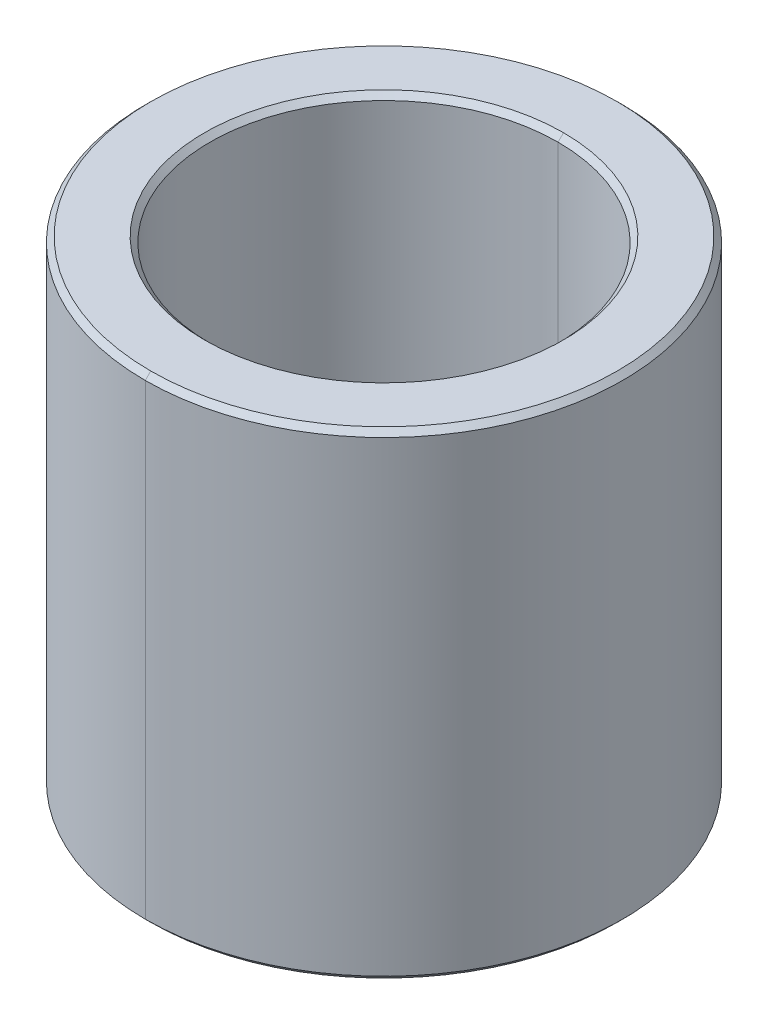
ISO-10303-21;
HEADER;
FILE_DESCRIPTION(('STEP AP214'),'2;1');
FILE_NAME('part.step','',(''),(''),'','','');
FILE_SCHEMA(('AUTOMOTIVE_DESIGN { 1 0 10303 214 1 1 1 1 }'));
ENDSEC;
DATA;
#1=APPLICATION_CONTEXT('core data for automotive mechanical design processes');
#2=APPLICATION_PROTOCOL_DEFINITION('international standard','automotive_design',2000,#1);
#3=PRODUCT_CONTEXT('',#1,'mechanical');
#4=PRODUCT('Part','Part','',(#3));
#5=PRODUCT_RELATED_PRODUCT_CATEGORY('part','',(#4));
#6=PRODUCT_DEFINITION_FORMATION('','',#4);
#7=PRODUCT_DEFINITION_CONTEXT('part definition',#1,'design');
#8=PRODUCT_DEFINITION('design','',#6,#7);
#9=PRODUCT_DEFINITION_SHAPE('','',#8);
#10=(LENGTH_UNIT() NAMED_UNIT(*) SI_UNIT(.MILLI.,.METRE.));
#11=(NAMED_UNIT(*) PLANE_ANGLE_UNIT() SI_UNIT($,.RADIAN.));
#12=(NAMED_UNIT(*) SI_UNIT($,.STERADIAN.) SOLID_ANGLE_UNIT());
#13=UNCERTAINTY_MEASURE_WITH_UNIT(LENGTH_MEASURE(1.E-05),#10,'distance_accuracy_value','');
#14=(GEOMETRIC_REPRESENTATION_CONTEXT(3) GLOBAL_UNCERTAINTY_ASSIGNED_CONTEXT((#13)) GLOBAL_UNIT_ASSIGNED_CONTEXT((#10,
#11,#12)) REPRESENTATION_CONTEXT('',''));
#15=CARTESIAN_POINT('',(0.,0.,0.));
#16=DIRECTION('',(0.,0.,1.));
#17=DIRECTION('',(1.,0.,0.));
#18=AXIS2_PLACEMENT_3D('',#15,#16,#17);
#19=CARTESIAN_POINT('',(0.,11.1125,0.));
#20=DIRECTION('',(0.,-1.,0.));
#21=DIRECTION('',(0.,0.,-1.));
#22=AXIS2_PLACEMENT_3D('',#19,#20,#21);
#23=CONICAL_SURFACE('',#22,5.42925,0.785398163397448);
#24=DIRECTION('',(0.,-0.707106781186548,0.707106781186548));
#25=VECTOR('',#24,1.);
#26=CARTESIAN_POINT('',(0.,11.1125,5.42925));
#27=LINE('',#26,#25);
#28=CARTESIAN_POINT('',(0.,11.1125,5.42925));
#29=VERTEX_POINT('',#28);
#30=CARTESIAN_POINT('',(0.,10.9855,5.55625));
#31=VERTEX_POINT('',#30);
#32=EDGE_CURVE('E166',#29,#31,#27,.T.);
#33=ORIENTED_EDGE('',*,*,#32,.F.);
#34=CARTESIAN_POINT('',(0.,11.1125,0.));
#35=DIRECTION('',(0.,1.,0.));
#36=DIRECTION('',(0.,0.,1.));
#37=AXIS2_PLACEMENT_3D('',#34,#35,#36);
#38=CIRCLE('',#37,5.42925);
#39=CARTESIAN_POINT('',(0.,11.1125,-5.42925));
#40=VERTEX_POINT('',#39);
#41=EDGE_CURVE('E76',#40,#29,#38,.T.);
#42=ORIENTED_EDGE('',*,*,#41,.F.);
#43=DIRECTION('',(0.,-0.707106781186548,-0.707106781186548));
#44=VECTOR('',#43,1.);
#45=CARTESIAN_POINT('',(0.,11.1125,-5.42925));
#46=LINE('',#45,#44);
#47=CARTESIAN_POINT('',(0.,10.9855,-5.55625));
#48=VERTEX_POINT('',#47);
#49=EDGE_CURVE('E156',#40,#48,#46,.T.);
#50=ORIENTED_EDGE('',*,*,#49,.T.);
#51=CARTESIAN_POINT('',(0.,10.9855,0.));
#52=DIRECTION('',(0.,-1.,0.));
#53=DIRECTION('',(0.,0.,1.));
#54=AXIS2_PLACEMENT_3D('',#51,#52,#53);
#55=CIRCLE('',#54,5.55625);
#56=EDGE_CURVE('E128',#31,#48,#55,.T.);
#57=ORIENTED_EDGE('',*,*,#56,.F.);
#58=EDGE_LOOP('',(#33,#42,#50,#57));
#59=FACE_BOUND('',#58,.T.);
#60=ADVANCED_FACE('F16',(#59),#23,.T.);
#61=CARTESIAN_POINT('',(0.,10.9855,0.));
#62=DIRECTION('',(0.,1.,0.));
#63=DIRECTION('',(0.,0.,1.));
#64=AXIS2_PLACEMENT_3D('',#61,#62,#63);
#65=CONICAL_SURFACE('',#64,4.0513,0.785398163397442);
#66=DIRECTION('',(0.,0.707106781186552,-0.707106781186543));
#67=VECTOR('',#66,1.);
#68=CARTESIAN_POINT('',(0.,10.9855,-4.0513));
#69=LINE('',#68,#67);
#70=CARTESIAN_POINT('',(0.,10.9855,-4.0513));
#71=VERTEX_POINT('',#70);
#72=CARTESIAN_POINT('',(0.,11.1125,-4.1783));
#73=VERTEX_POINT('',#72);
#74=EDGE_CURVE('E163',#71,#73,#69,.T.);
#75=ORIENTED_EDGE('',*,*,#74,.F.);
#76=CARTESIAN_POINT('',(0.,10.9855,0.));
#77=DIRECTION('',(0.,1.,0.));
#78=DIRECTION('',(0.,0.,1.));
#79=AXIS2_PLACEMENT_3D('',#76,#77,#78);
#80=CIRCLE('',#79,4.0513);
#81=CARTESIAN_POINT('',(0.,10.9855,4.0513));
#82=VERTEX_POINT('',#81);
#83=EDGE_CURVE('E27',#82,#71,#80,.T.);
#84=ORIENTED_EDGE('',*,*,#83,.F.);
#85=DIRECTION('',(0.,0.707106781186552,0.707106781186543));
#86=VECTOR('',#85,1.);
#87=CARTESIAN_POINT('',(0.,10.9855,4.0513));
#88=LINE('',#87,#86);
#89=CARTESIAN_POINT('',(0.,11.1125,4.1783));
#90=VERTEX_POINT('',#89);
#91=EDGE_CURVE('E153',#82,#90,#88,.T.);
#92=ORIENTED_EDGE('',*,*,#91,.T.);
#93=CARTESIAN_POINT('',(0.,11.1125,0.));
#94=DIRECTION('',(0.,-1.,0.));
#95=DIRECTION('',(0.,0.,1.));
#96=AXIS2_PLACEMENT_3D('',#93,#94,#95);
#97=CIRCLE('',#96,4.1783);
#98=EDGE_CURVE('E176',#73,#90,#97,.T.);
#99=ORIENTED_EDGE('',*,*,#98,.F.);
#100=EDGE_LOOP('',(#75,#84,#92,#99));
#101=FACE_BOUND('',#100,.T.);
#102=ADVANCED_FACE('F341',(#101),#65,.F.);
#103=CARTESIAN_POINT('',(0.,0.126999999999997,0.));
#104=DIRECTION('',(0.,1.,0.));
#105=DIRECTION('',(0.,0.,1.));
#106=AXIS2_PLACEMENT_3D('',#103,#104,#105);
#107=CONICAL_SURFACE('',#106,5.55625,0.785398163397452);
#108=DIRECTION('',(0.,0.707106781186545,-0.70710678118655));
#109=VECTOR('',#108,1.);
#110=CARTESIAN_POINT('',(0.,0.126999999999997,-5.55625));
#111=LINE('',#110,#109);
#112=CARTESIAN_POINT('',(0.,0.,-5.42925));
#113=VERTEX_POINT('',#112);
#114=CARTESIAN_POINT('',(0.,0.126999999999997,-5.55625));
#115=VERTEX_POINT('',#114);
#116=EDGE_CURVE('E122',#113,#115,#111,.T.);
#117=ORIENTED_EDGE('',*,*,#116,.F.);
#118=CARTESIAN_POINT('',(0.,0.,0.));
#119=DIRECTION('',(0.,-1.,0.));
#120=DIRECTION('',(0.,0.,1.));
#121=AXIS2_PLACEMENT_3D('',#118,#119,#120);
#122=CIRCLE('',#121,5.42925);
#123=CARTESIAN_POINT('',(0.,0.,5.42925));
#124=VERTEX_POINT('',#123);
#125=EDGE_CURVE('E179',#124,#113,#122,.T.);
#126=ORIENTED_EDGE('',*,*,#125,.F.);
#127=DIRECTION('',(0.,0.707106781186545,0.70710678118655));
#128=VECTOR('',#127,1.);
#129=CARTESIAN_POINT('',(0.,0.126999999999997,5.55625));
#130=LINE('',#129,#128);
#131=CARTESIAN_POINT('',(0.,0.126999999999997,5.55625));
#132=VERTEX_POINT('',#131);
#133=EDGE_CURVE('E125',#124,#132,#130,.T.);
#134=ORIENTED_EDGE('',*,*,#133,.T.);
#135=CARTESIAN_POINT('',(0.,0.126999999999997,0.));
#136=DIRECTION('',(0.,1.,0.));
#137=DIRECTION('',(0.,0.,1.));
#138=AXIS2_PLACEMENT_3D('',#135,#136,#137);
#139=CIRCLE('',#138,5.55625);
#140=EDGE_CURVE('E112',#115,#132,#139,.T.);
#141=ORIENTED_EDGE('',*,*,#140,.F.);
#142=EDGE_LOOP('',(#117,#126,#134,#141));
#143=FACE_BOUND('',#142,.T.);
#144=ADVANCED_FACE('F120',(#143),#107,.T.);
#145=CARTESIAN_POINT('',(0.,0.,0.));
#146=DIRECTION('',(0.,-1.,0.));
#147=DIRECTION('',(0.,0.,-1.));
#148=AXIS2_PLACEMENT_3D('',#145,#146,#147);
#149=CONICAL_SURFACE('',#148,4.1783,0.785398163397448);
#150=DIRECTION('',(0.,-0.707106781186548,0.707106781186548));
#151=VECTOR('',#150,1.);
#152=CARTESIAN_POINT('',(0.,0.,4.1783));
#153=LINE('',#152,#151);
#154=CARTESIAN_POINT('',(0.,0.127,4.0513));
#155=VERTEX_POINT('',#154);
#156=CARTESIAN_POINT('',(0.,0.,4.1783));
#157=VERTEX_POINT('',#156);
#158=EDGE_CURVE('E20',#155,#157,#153,.T.);
#159=ORIENTED_EDGE('',*,*,#158,.F.);
#160=CARTESIAN_POINT('',(0.,0.127,0.));
#161=DIRECTION('',(0.,-1.,0.));
#162=DIRECTION('',(0.,0.,1.));
#163=AXIS2_PLACEMENT_3D('',#160,#161,#162);
#164=CIRCLE('',#163,4.0513);
#165=CARTESIAN_POINT('',(0.,0.127,-4.0513));
#166=VERTEX_POINT('',#165);
#167=EDGE_CURVE('E11',#166,#155,#164,.T.);
#168=ORIENTED_EDGE('',*,*,#167,.F.);
#169=DIRECTION('',(0.,-0.707106781186548,-0.707106781186548));
#170=VECTOR('',#169,1.);
#171=CARTESIAN_POINT('',(0.,0.,-4.1783));
#172=LINE('',#171,#170);
#173=CARTESIAN_POINT('',(0.,0.,-4.1783));
#174=VERTEX_POINT('',#173);
#175=EDGE_CURVE('E185',#166,#174,#172,.T.);
#176=ORIENTED_EDGE('',*,*,#175,.T.);
#177=CARTESIAN_POINT('',(0.,0.,0.));
#178=DIRECTION('',(0.,1.,0.));
#179=DIRECTION('',(0.,0.,1.));
#180=AXIS2_PLACEMENT_3D('',#177,#178,#179);
#181=CIRCLE('',#180,4.1783);
#182=EDGE_CURVE('E41',#157,#174,#181,.T.);
#183=ORIENTED_EDGE('',*,*,#182,.F.);
#184=EDGE_LOOP('',(#159,#168,#176,#183));
#185=FACE_BOUND('',#184,.T.);
#186=ADVANCED_FACE('F234',(#185),#149,.F.);
#187=CARTESIAN_POINT('',(0.,11.1125,0.));
#188=DIRECTION('',(0.,-1.,0.));
#189=DIRECTION('',(0.,0.,-1.));
#190=AXIS2_PLACEMENT_3D('',#187,#188,#189);
#191=CYLINDRICAL_SURFACE('',#190,4.0513);
#192=DIRECTION('',(0.,-1.,0.));
#193=VECTOR('',#192,1.);
#194=CARTESIAN_POINT('',(0.,11.1125,4.0513));
#195=LINE('',#194,#193);
#196=EDGE_CURVE('E180',#82,#155,#195,.T.);
#197=ORIENTED_EDGE('',*,*,#196,.F.);
#198=ORIENTED_EDGE('',*,*,#83,.T.);
#199=DIRECTION('',(0.,-1.,0.));
#200=VECTOR('',#199,1.);
#201=CARTESIAN_POINT('',(0.,11.1125,-4.0513));
#202=LINE('',#201,#200);
#203=EDGE_CURVE('E184',#71,#166,#202,.T.);
#204=ORIENTED_EDGE('',*,*,#203,.T.);
#205=ORIENTED_EDGE('',*,*,#167,.T.);
#206=EDGE_LOOP('',(#197,#198,#204,#205));
#207=FACE_BOUND('',#206,.T.);
#208=ADVANCED_FACE('F220',(#207),#191,.F.);
#209=CARTESIAN_POINT('',(0.,11.1125,0.));
#210=DIRECTION('',(0.,-1.,0.));
#211=DIRECTION('',(0.,0.,-1.));
#212=AXIS2_PLACEMENT_3D('',#209,#210,#211);
#213=CYLINDRICAL_SURFACE('',#212,5.55625);
#214=DIRECTION('',(0.,-1.,0.));
#215=VECTOR('',#214,1.);
#216=CARTESIAN_POINT('',(0.,11.1125,5.55625));
#217=LINE('',#216,#215);
#218=EDGE_CURVE('E137',#31,#132,#217,.T.);
#219=ORIENTED_EDGE('',*,*,#218,.F.);
#220=ORIENTED_EDGE('',*,*,#56,.T.);
#221=DIRECTION('',(0.,-1.,0.));
#222=VECTOR('',#221,1.);
#223=CARTESIAN_POINT('',(0.,11.1125,-5.55625));
#224=LINE('',#223,#222);
#225=EDGE_CURVE('E131',#48,#115,#224,.T.);
#226=ORIENTED_EDGE('',*,*,#225,.T.);
#227=ORIENTED_EDGE('',*,*,#140,.T.);
#228=EDGE_LOOP('',(#219,#220,#226,#227));
#229=FACE_BOUND('',#228,.T.);
#230=ADVANCED_FACE('F133',(#229),#213,.T.);
#231=CARTESIAN_POINT('',(0.,0.,0.));
#232=DIRECTION('',(0.,1.,0.));
#233=DIRECTION('',(1.,0.,0.));
#234=AXIS2_PLACEMENT_3D('',#231,#232,#233);
#235=PLANE('',#234);
#236=CARTESIAN_POINT('',(0.,0.,0.));
#237=DIRECTION('',(0.,1.,0.));
#238=DIRECTION('',(0.,0.,1.));
#239=AXIS2_PLACEMENT_3D('',#236,#237,#238);
#240=CIRCLE('',#239,4.1783);
#241=EDGE_CURVE('E190',#174,#157,#240,.T.);
#242=ORIENTED_EDGE('',*,*,#241,.T.);
#243=ORIENTED_EDGE('',*,*,#182,.T.);
#244=EDGE_LOOP('',(#242,#243));
#245=FACE_BOUND('',#244,.T.);
#246=ORIENTED_EDGE('',*,*,#125,.T.);
#247=CARTESIAN_POINT('',(0.,0.,0.));
#248=DIRECTION('',(0.,-1.,0.));
#249=DIRECTION('',(0.,0.,1.));
#250=AXIS2_PLACEMENT_3D('',#247,#248,#249);
#251=CIRCLE('',#250,5.42925);
#252=EDGE_CURVE('E146',#113,#124,#251,.T.);
#253=ORIENTED_EDGE('',*,*,#252,.T.);
#254=EDGE_LOOP('',(#246,#253));
#255=FACE_BOUND('',#254,.T.);
#256=ADVANCED_FACE('F332',(#245,#255),#235,.F.);
#257=CARTESIAN_POINT('',(0.,11.1125,0.));
#258=DIRECTION('',(0.,1.,0.));
#259=DIRECTION('',(1.,0.,0.));
#260=AXIS2_PLACEMENT_3D('',#257,#258,#259);
#261=PLANE('',#260);
#262=CARTESIAN_POINT('',(0.,11.1125,0.));
#263=DIRECTION('',(0.,-1.,0.));
#264=DIRECTION('',(0.,0.,1.));
#265=AXIS2_PLACEMENT_3D('',#262,#263,#264);
#266=CIRCLE('',#265,4.1783);
#267=EDGE_CURVE('E159',#90,#73,#266,.T.);
#268=ORIENTED_EDGE('',*,*,#267,.T.);
#269=ORIENTED_EDGE('',*,*,#98,.T.);
#270=EDGE_LOOP('',(#268,#269));
#271=FACE_BOUND('',#270,.T.);
#272=ORIENTED_EDGE('',*,*,#41,.T.);
#273=CARTESIAN_POINT('',(0.,11.1125,0.));
#274=DIRECTION('',(0.,1.,0.));
#275=DIRECTION('',(0.,0.,1.));
#276=AXIS2_PLACEMENT_3D('',#273,#274,#275);
#277=CIRCLE('',#276,5.42925);
#278=EDGE_CURVE('E171',#29,#40,#277,.T.);
#279=ORIENTED_EDGE('',*,*,#278,.T.);
#280=EDGE_LOOP('',(#272,#279));
#281=FACE_BOUND('',#280,.T.);
#282=ADVANCED_FACE('F328',(#271,#281),#261,.T.);
#283=CARTESIAN_POINT('',(0.,11.1125,0.));
#284=DIRECTION('',(0.,-1.,0.));
#285=DIRECTION('',(0.,0.,-1.));
#286=AXIS2_PLACEMENT_3D('',#283,#284,#285);
#287=CYLINDRICAL_SURFACE('',#286,5.55625);
#288=CARTESIAN_POINT('',(0.,10.9855,0.));
#289=DIRECTION('',(0.,-1.,0.));
#290=DIRECTION('',(0.,0.,1.));
#291=AXIS2_PLACEMENT_3D('',#288,#289,#290);
#292=CIRCLE('',#291,5.55625);
#293=EDGE_CURVE('E170',#48,#31,#292,.T.);
#294=ORIENTED_EDGE('',*,*,#293,.T.);
#295=ORIENTED_EDGE('',*,*,#218,.T.);
#296=CARTESIAN_POINT('',(0.,0.126999999999997,0.));
#297=DIRECTION('',(0.,1.,0.));
#298=DIRECTION('',(0.,0.,1.));
#299=AXIS2_PLACEMENT_3D('',#296,#297,#298);
#300=CIRCLE('',#299,5.55625);
#301=EDGE_CURVE('E139',#132,#115,#300,.T.);
#302=ORIENTED_EDGE('',*,*,#301,.T.);
#303=ORIENTED_EDGE('',*,*,#225,.F.);
#304=EDGE_LOOP('',(#294,#295,#302,#303));
#305=FACE_BOUND('',#304,.T.);
#306=ADVANCED_FACE('F140',(#305),#287,.T.);
#307=CARTESIAN_POINT('',(0.,11.1125,0.));
#308=DIRECTION('',(0.,-1.,0.));
#309=DIRECTION('',(0.,0.,-1.));
#310=AXIS2_PLACEMENT_3D('',#307,#308,#309);
#311=CYLINDRICAL_SURFACE('',#310,4.0513);
#312=CARTESIAN_POINT('',(0.,10.9855,0.));
#313=DIRECTION('',(0.,1.,0.));
#314=DIRECTION('',(0.,0.,1.));
#315=AXIS2_PLACEMENT_3D('',#312,#313,#314);
#316=CIRCLE('',#315,4.0513);
#317=EDGE_CURVE('E232',#71,#82,#316,.T.);
#318=ORIENTED_EDGE('',*,*,#317,.T.);
#319=ORIENTED_EDGE('',*,*,#196,.T.);
#320=CARTESIAN_POINT('',(0.,0.127,0.));
#321=DIRECTION('',(0.,-1.,0.));
#322=DIRECTION('',(0.,0.,1.));
#323=AXIS2_PLACEMENT_3D('',#320,#321,#322);
#324=CIRCLE('',#323,4.0513);
#325=EDGE_CURVE('E172',#155,#166,#324,.T.);
#326=ORIENTED_EDGE('',*,*,#325,.T.);
#327=ORIENTED_EDGE('',*,*,#203,.F.);
#328=EDGE_LOOP('',(#318,#319,#326,#327));
#329=FACE_BOUND('',#328,.T.);
#330=ADVANCED_FACE('F229',(#329),#311,.F.);
#331=CARTESIAN_POINT('',(0.,0.,0.));
#332=DIRECTION('',(0.,-1.,0.));
#333=DIRECTION('',(0.,0.,-1.));
#334=AXIS2_PLACEMENT_3D('',#331,#332,#333);
#335=CONICAL_SURFACE('',#334,4.1783,0.785398163397448);
#336=ORIENTED_EDGE('',*,*,#325,.F.);
#337=ORIENTED_EDGE('',*,*,#158,.T.);
#338=ORIENTED_EDGE('',*,*,#241,.F.);
#339=ORIENTED_EDGE('',*,*,#175,.F.);
#340=EDGE_LOOP('',(#336,#337,#338,#339));
#341=FACE_BOUND('',#340,.T.);
#342=ADVANCED_FACE('F18',(#341),#335,.F.);
#343=CARTESIAN_POINT('',(0.,0.126999999999997,0.));
#344=DIRECTION('',(0.,1.,0.));
#345=DIRECTION('',(0.,0.,1.));
#346=AXIS2_PLACEMENT_3D('',#343,#344,#345);
#347=CONICAL_SURFACE('',#346,5.55625,0.785398163397452);
#348=ORIENTED_EDGE('',*,*,#252,.F.);
#349=ORIENTED_EDGE('',*,*,#116,.T.);
#350=ORIENTED_EDGE('',*,*,#301,.F.);
#351=ORIENTED_EDGE('',*,*,#133,.F.);
#352=EDGE_LOOP('',(#348,#349,#350,#351));
#353=FACE_BOUND('',#352,.T.);
#354=ADVANCED_FACE('F144',(#353),#347,.T.);
#355=CARTESIAN_POINT('',(0.,10.9855,0.));
#356=DIRECTION('',(0.,1.,0.));
#357=DIRECTION('',(0.,0.,1.));
#358=AXIS2_PLACEMENT_3D('',#355,#356,#357);
#359=CONICAL_SURFACE('',#358,4.0513,0.785398163397442);
#360=ORIENTED_EDGE('',*,*,#317,.F.);
#361=ORIENTED_EDGE('',*,*,#74,.T.);
#362=ORIENTED_EDGE('',*,*,#267,.F.);
#363=ORIENTED_EDGE('',*,*,#91,.F.);
#364=EDGE_LOOP('',(#360,#361,#362,#363));
#365=FACE_BOUND('',#364,.T.);
#366=ADVANCED_FACE('F349',(#365),#359,.F.);
#367=CARTESIAN_POINT('',(0.,11.1125,0.));
#368=DIRECTION('',(0.,-1.,0.));
#369=DIRECTION('',(0.,0.,-1.));
#370=AXIS2_PLACEMENT_3D('',#367,#368,#369);
#371=CONICAL_SURFACE('',#370,5.42925,0.785398163397448);
#372=ORIENTED_EDGE('',*,*,#278,.F.);
#373=ORIENTED_EDGE('',*,*,#32,.T.);
#374=ORIENTED_EDGE('',*,*,#293,.F.);
#375=ORIENTED_EDGE('',*,*,#49,.F.);
#376=EDGE_LOOP('',(#372,#373,#374,#375));
#377=FACE_BOUND('',#376,.T.);
#378=ADVANCED_FACE('F378',(#377),#371,.T.);
#379=CLOSED_SHELL('',(#60,#102,#144,#186,#208,#230,#256,#282,#306,#330,#342,#354,#366,#378));
#380=MANIFOLD_SOLID_BREP('B1',#379);
#381=ADVANCED_BREP_SHAPE_REPRESENTATION('',(#18,#380),#14);
#382=SHAPE_DEFINITION_REPRESENTATION(#9,#381);
ENDSEC;
END-ISO-10303-21;
